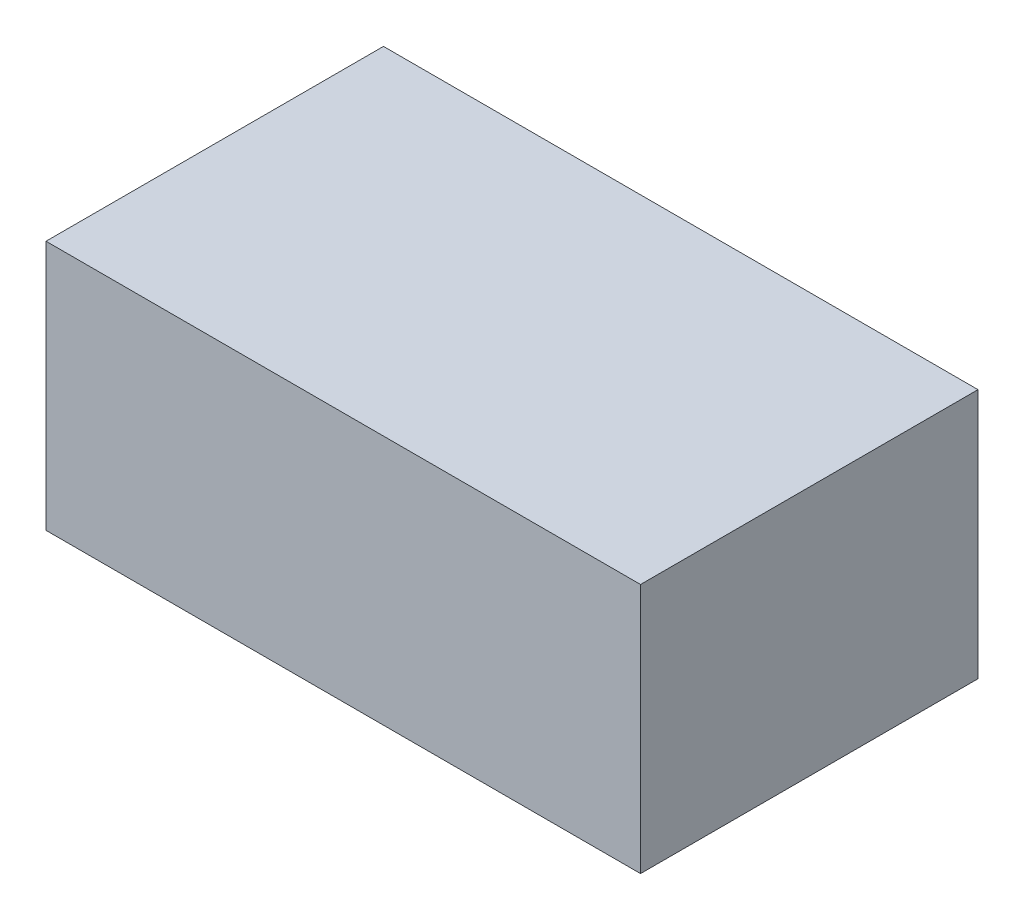
ISO-10303-21;
HEADER;
FILE_DESCRIPTION(('STEP AP214'),'2;1');
FILE_NAME('part.step','',(''),(''),'','','');
FILE_SCHEMA(('AUTOMOTIVE_DESIGN { 1 0 10303 214 1 1 1 1 }'));
ENDSEC;
DATA;
#1=APPLICATION_CONTEXT('core data for automotive mechanical design processes');
#2=APPLICATION_PROTOCOL_DEFINITION('international standard','automotive_design',2000,#1);
#3=PRODUCT_CONTEXT('',#1,'mechanical');
#4=PRODUCT('Part','Part','',(#3));
#5=PRODUCT_RELATED_PRODUCT_CATEGORY('part','',(#4));
#6=PRODUCT_DEFINITION_FORMATION('','',#4);
#7=PRODUCT_DEFINITION_CONTEXT('part definition',#1,'design');
#8=PRODUCT_DEFINITION('design','',#6,#7);
#9=PRODUCT_DEFINITION_SHAPE('','',#8);
#10=(LENGTH_UNIT() NAMED_UNIT(*) SI_UNIT(.MILLI.,.METRE.));
#11=(NAMED_UNIT(*) PLANE_ANGLE_UNIT() SI_UNIT($,.RADIAN.));
#12=(NAMED_UNIT(*) SI_UNIT($,.STERADIAN.) SOLID_ANGLE_UNIT());
#13=UNCERTAINTY_MEASURE_WITH_UNIT(LENGTH_MEASURE(1.E-05),#10,'distance_accuracy_value','');
#14=(GEOMETRIC_REPRESENTATION_CONTEXT(3) GLOBAL_UNCERTAINTY_ASSIGNED_CONTEXT((#13)) GLOBAL_UNIT_ASSIGNED_CONTEXT((#10,
#11,#12)) REPRESENTATION_CONTEXT('',''));
#15=CARTESIAN_POINT('',(0.,0.,0.));
#16=DIRECTION('',(0.,0.,1.));
#17=DIRECTION('',(1.,0.,0.));
#18=AXIS2_PLACEMENT_3D('',#15,#16,#17);
#19=CARTESIAN_POINT('',(83.1025667168324,35.,47.1709241404971));
#20=DIRECTION('',(-1.,0.,0.));
#21=DIRECTION('',(0.,0.,1.));
#22=AXIS2_PLACEMENT_3D('',#19,#20,#21);
#23=PLANE('',#22);
#24=DIRECTION('',(0.,0.,-1.));
#25=VECTOR('',#24,1.);
#26=CARTESIAN_POINT('',(83.1025667168324,-35.,47.1709241404971));
#27=LINE('',#26,#25);
#28=CARTESIAN_POINT('',(83.1025667168324,-35.,47.1709241404971));
#29=VERTEX_POINT('',#28);
#30=CARTESIAN_POINT('',(83.1025667168324,-35.,-47.1709241404971));
#31=VERTEX_POINT('',#30);
#32=EDGE_CURVE('E113',#29,#31,#27,.T.);
#33=ORIENTED_EDGE('',*,*,#32,.T.);
#34=DIRECTION('',(0.,-1.,0.));
#35=VECTOR('',#34,1.);
#36=CARTESIAN_POINT('',(83.1025667168324,35.,-47.1709241404971));
#37=LINE('',#36,#35);
#38=CARTESIAN_POINT('',(83.1025667168324,35.,-47.1709241404971));
#39=VERTEX_POINT('',#38);
#40=EDGE_CURVE('E11',#39,#31,#37,.T.);
#41=ORIENTED_EDGE('',*,*,#40,.F.);
#42=DIRECTION('',(0.,0.,-1.));
#43=VECTOR('',#42,1.);
#44=CARTESIAN_POINT('',(83.1025667168324,35.,47.1709241404971));
#45=LINE('',#44,#43);
#46=CARTESIAN_POINT('',(83.1025667168324,35.,47.1709241404971));
#47=VERTEX_POINT('',#46);
#48=EDGE_CURVE('E97',#47,#39,#45,.T.);
#49=ORIENTED_EDGE('',*,*,#48,.F.);
#50=DIRECTION('',(0.,-1.,0.));
#51=VECTOR('',#50,1.);
#52=CARTESIAN_POINT('',(83.1025667168324,35.,47.1709241404971));
#53=LINE('',#52,#51);
#54=EDGE_CURVE('E109',#47,#29,#53,.T.);
#55=ORIENTED_EDGE('',*,*,#54,.T.);
#56=EDGE_LOOP('',(#33,#41,#49,#55));
#57=FACE_BOUND('',#56,.T.);
#58=ADVANCED_FACE('F45',(#57),#23,.F.);
#59=CARTESIAN_POINT('',(-83.1025667168324,35.,-47.1709241404971));
#60=DIRECTION('',(0.,0.,1.));
#61=DIRECTION('',(1.,0.,0.));
#62=AXIS2_PLACEMENT_3D('',#59,#60,#61);
#63=PLANE('',#62);
#64=DIRECTION('',(-1.,0.,0.));
#65=VECTOR('',#64,1.);
#66=CARTESIAN_POINT('',(-83.1025667168324,-35.,-47.1709241404971));
#67=LINE('',#66,#65);
#68=CARTESIAN_POINT('',(-83.1025667168324,-35.,-47.1709241404971));
#69=VERTEX_POINT('',#68);
#70=EDGE_CURVE('E102',#31,#69,#67,.T.);
#71=ORIENTED_EDGE('',*,*,#70,.T.);
#72=DIRECTION('',(0.,-1.,0.));
#73=VECTOR('',#72,1.);
#74=CARTESIAN_POINT('',(-83.1025667168324,35.,-47.1709241404971));
#75=LINE('',#74,#73);
#76=CARTESIAN_POINT('',(-83.1025667168324,35.,-47.1709241404971));
#77=VERTEX_POINT('',#76);
#78=EDGE_CURVE('E54',#77,#69,#75,.T.);
#79=ORIENTED_EDGE('',*,*,#78,.F.);
#80=DIRECTION('',(-1.,0.,0.));
#81=VECTOR('',#80,1.);
#82=CARTESIAN_POINT('',(-83.1025667168324,35.,-47.1709241404971));
#83=LINE('',#82,#81);
#84=EDGE_CURVE('E92',#39,#77,#83,.T.);
#85=ORIENTED_EDGE('',*,*,#84,.F.);
#86=ORIENTED_EDGE('',*,*,#40,.T.);
#87=EDGE_LOOP('',(#71,#79,#85,#86));
#88=FACE_BOUND('',#87,.T.);
#89=ADVANCED_FACE('F101',(#88),#63,.F.);
#90=CARTESIAN_POINT('',(-83.1025667168324,35.,47.1709241404971));
#91=DIRECTION('',(1.,0.,0.));
#92=DIRECTION('',(0.,0.,-1.));
#93=AXIS2_PLACEMENT_3D('',#90,#91,#92);
#94=PLANE('',#93);
#95=DIRECTION('',(0.,0.,1.));
#96=VECTOR('',#95,1.);
#97=CARTESIAN_POINT('',(-83.1025667168324,-35.,47.1709241404971));
#98=LINE('',#97,#96);
#99=CARTESIAN_POINT('',(-83.1025667168324,-35.,47.1709241404971));
#100=VERTEX_POINT('',#99);
#101=EDGE_CURVE('E79',#69,#100,#98,.T.);
#102=ORIENTED_EDGE('',*,*,#101,.T.);
#103=DIRECTION('',(0.,-1.,0.));
#104=VECTOR('',#103,1.);
#105=CARTESIAN_POINT('',(-83.1025667168324,35.,47.1709241404971));
#106=LINE('',#105,#104);
#107=CARTESIAN_POINT('',(-83.1025667168324,35.,47.1709241404971));
#108=VERTEX_POINT('',#107);
#109=EDGE_CURVE('E104',#108,#100,#106,.T.);
#110=ORIENTED_EDGE('',*,*,#109,.F.);
#111=DIRECTION('',(0.,0.,1.));
#112=VECTOR('',#111,1.);
#113=CARTESIAN_POINT('',(-83.1025667168324,35.,47.1709241404971));
#114=LINE('',#113,#112);
#115=EDGE_CURVE('E95',#77,#108,#114,.T.);
#116=ORIENTED_EDGE('',*,*,#115,.F.);
#117=ORIENTED_EDGE('',*,*,#78,.T.);
#118=EDGE_LOOP('',(#102,#110,#116,#117));
#119=FACE_BOUND('',#118,.T.);
#120=ADVANCED_FACE('F105',(#119),#94,.F.);
#121=CARTESIAN_POINT('',(-83.1025667168324,35.,47.1709241404971));
#122=DIRECTION('',(0.,0.,-1.));
#123=DIRECTION('',(-1.,0.,0.));
#124=AXIS2_PLACEMENT_3D('',#121,#122,#123);
#125=PLANE('',#124);
#126=DIRECTION('',(1.,0.,0.));
#127=VECTOR('',#126,1.);
#128=CARTESIAN_POINT('',(-83.1025667168324,-35.,47.1709241404971));
#129=LINE('',#128,#127);
#130=EDGE_CURVE('E85',#100,#29,#129,.T.);
#131=ORIENTED_EDGE('',*,*,#130,.T.);
#132=ORIENTED_EDGE('',*,*,#54,.F.);
#133=DIRECTION('',(1.,0.,0.));
#134=VECTOR('',#133,1.);
#135=CARTESIAN_POINT('',(-83.1025667168324,35.,47.1709241404971));
#136=LINE('',#135,#134);
#137=EDGE_CURVE('E62',#108,#47,#136,.T.);
#138=ORIENTED_EDGE('',*,*,#137,.F.);
#139=ORIENTED_EDGE('',*,*,#109,.T.);
#140=EDGE_LOOP('',(#131,#132,#138,#139));
#141=FACE_BOUND('',#140,.T.);
#142=ADVANCED_FACE('F126',(#141),#125,.F.);
#143=CARTESIAN_POINT('',(0.,35.,0.));
#144=DIRECTION('',(0.,-1.,0.));
#145=DIRECTION('',(0.,0.,-1.));
#146=AXIS2_PLACEMENT_3D('',#143,#144,#145);
#147=PLANE('',#146);
#148=ORIENTED_EDGE('',*,*,#48,.T.);
#149=ORIENTED_EDGE('',*,*,#84,.T.);
#150=ORIENTED_EDGE('',*,*,#115,.T.);
#151=ORIENTED_EDGE('',*,*,#137,.T.);
#152=EDGE_LOOP('',(#148,#149,#150,#151));
#153=FACE_BOUND('',#152,.T.);
#154=ADVANCED_FACE('F93',(#153),#147,.F.);
#155=CARTESIAN_POINT('',(0.,-35.,0.));
#156=DIRECTION('',(0.,-1.,0.));
#157=DIRECTION('',(0.,0.,-1.));
#158=AXIS2_PLACEMENT_3D('',#155,#156,#157);
#159=PLANE('',#158);
#160=ORIENTED_EDGE('',*,*,#32,.F.);
#161=ORIENTED_EDGE('',*,*,#130,.F.);
#162=ORIENTED_EDGE('',*,*,#101,.F.);
#163=ORIENTED_EDGE('',*,*,#70,.F.);
#164=EDGE_LOOP('',(#160,#161,#162,#163));
#165=FACE_BOUND('',#164,.T.);
#166=ADVANCED_FACE('F129',(#165),#159,.T.);
#167=CLOSED_SHELL('',(#58,#89,#120,#142,#154,#166));
#168=MANIFOLD_SOLID_BREP('B2',#167);
#169=ADVANCED_BREP_SHAPE_REPRESENTATION('',(#18,#168),#14);
#170=SHAPE_DEFINITION_REPRESENTATION(#9,#169);
ENDSEC;
END-ISO-10303-21;
